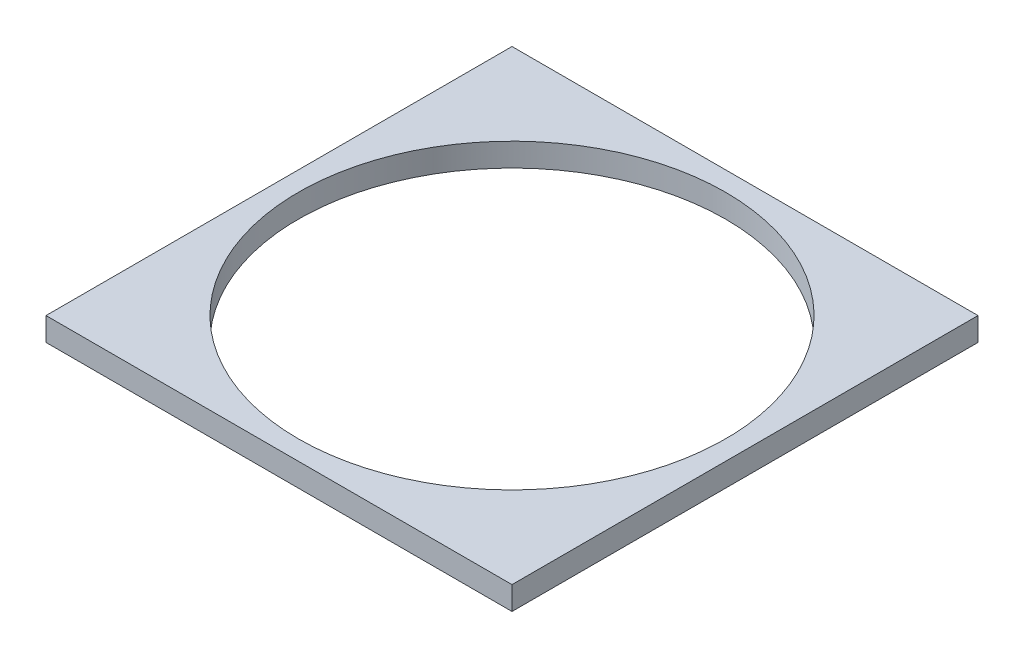
ISO-10303-21;
HEADER;
FILE_DESCRIPTION(('STEP AP214'),'2;1');
FILE_NAME('part.step','',(''),(''),'','','');
FILE_SCHEMA(('AUTOMOTIVE_DESIGN { 1 0 10303 214 1 1 1 1 }'));
ENDSEC;
DATA;
#1=APPLICATION_CONTEXT('core data for automotive mechanical design processes');
#2=APPLICATION_PROTOCOL_DEFINITION('international standard','automotive_design',2000,#1);
#3=PRODUCT_CONTEXT('',#1,'mechanical');
#4=PRODUCT('Part','Part','',(#3));
#5=PRODUCT_RELATED_PRODUCT_CATEGORY('part','',(#4));
#6=PRODUCT_DEFINITION_FORMATION('','',#4);
#7=PRODUCT_DEFINITION_CONTEXT('part definition',#1,'design');
#8=PRODUCT_DEFINITION('design','',#6,#7);
#9=PRODUCT_DEFINITION_SHAPE('','',#8);
#10=(LENGTH_UNIT() NAMED_UNIT(*) SI_UNIT(.MILLI.,.METRE.));
#11=(NAMED_UNIT(*) PLANE_ANGLE_UNIT() SI_UNIT($,.RADIAN.));
#12=(NAMED_UNIT(*) SI_UNIT($,.STERADIAN.) SOLID_ANGLE_UNIT());
#13=UNCERTAINTY_MEASURE_WITH_UNIT(LENGTH_MEASURE(1.E-05),#10,'distance_accuracy_value','');
#14=(GEOMETRIC_REPRESENTATION_CONTEXT(3) GLOBAL_UNCERTAINTY_ASSIGNED_CONTEXT((#13)) GLOBAL_UNIT_ASSIGNED_CONTEXT((#10,
#11,#12)) REPRESENTATION_CONTEXT('',''));
#15=CARTESIAN_POINT('',(0.,0.,0.));
#16=DIRECTION('',(0.,0.,1.));
#17=DIRECTION('',(1.,0.,0.));
#18=AXIS2_PLACEMENT_3D('',#15,#16,#17);
#19=CARTESIAN_POINT('',(0.,7.62,0.));
#20=DIRECTION('',(0.,1.,0.));
#21=DIRECTION('',(0.,0.,1.));
#22=AXIS2_PLACEMENT_3D('',#19,#20,#21);
#23=PLANE('',#22);
#24=DIRECTION('',(0.,0.,-1.));
#25=VECTOR('',#24,1.);
#26=CARTESIAN_POINT('',(76.2,7.62,-76.2));
#27=LINE('',#26,#25);
#28=CARTESIAN_POINT('',(76.2,7.62,76.2));
#29=VERTEX_POINT('',#28);
#30=CARTESIAN_POINT('',(76.2,7.62,-76.2));
#31=VERTEX_POINT('',#30);
#32=EDGE_CURVE('E90',#29,#31,#27,.T.);
#33=ORIENTED_EDGE('',*,*,#32,.T.);
#34=DIRECTION('',(-1.,0.,0.));
#35=VECTOR('',#34,1.);
#36=CARTESIAN_POINT('',(-76.2,7.62,-76.2));
#37=LINE('',#36,#35);
#38=CARTESIAN_POINT('',(-76.2,7.62,-76.2));
#39=VERTEX_POINT('',#38);
#40=EDGE_CURVE('E85',#31,#39,#37,.T.);
#41=ORIENTED_EDGE('',*,*,#40,.T.);
#42=DIRECTION('',(0.,0.,1.));
#43=VECTOR('',#42,1.);
#44=CARTESIAN_POINT('',(-76.2,7.62,-76.2));
#45=LINE('',#44,#43);
#46=CARTESIAN_POINT('',(-76.2,7.62,76.2));
#47=VERTEX_POINT('',#46);
#48=EDGE_CURVE('E88',#39,#47,#45,.T.);
#49=ORIENTED_EDGE('',*,*,#48,.T.);
#50=DIRECTION('',(1.,0.,0.));
#51=VECTOR('',#50,1.);
#52=CARTESIAN_POINT('',(-76.2,7.62,76.2));
#53=LINE('',#52,#51);
#54=EDGE_CURVE('E55',#47,#29,#53,.T.);
#55=ORIENTED_EDGE('',*,*,#54,.T.);
#56=EDGE_LOOP('',(#33,#41,#49,#55));
#57=FACE_BOUND('',#56,.T.);
#58=CARTESIAN_POINT('',(0.,7.62,0.));
#59=DIRECTION('',(0.,1.,0.));
#60=DIRECTION('',(0.,0.,1.));
#61=AXIS2_PLACEMENT_3D('',#58,#59,#60);
#62=CIRCLE('',#61,69.85);
#63=CARTESIAN_POINT('',(0.,7.62,69.85));
#64=VERTEX_POINT('',#63);
#65=EDGE_CURVE('E105',#64,#64,#62,.T.);
#66=ORIENTED_EDGE('',*,*,#65,.F.);
#67=EDGE_LOOP('',(#66));
#68=FACE_BOUND('',#67,.T.);
#69=ADVANCED_FACE('F38',(#57,#68),#23,.T.);
#70=CARTESIAN_POINT('',(0.,0.,0.));
#71=DIRECTION('',(0.,1.,0.));
#72=DIRECTION('',(0.,0.,1.));
#73=AXIS2_PLACEMENT_3D('',#70,#71,#72);
#74=PLANE('',#73);
#75=DIRECTION('',(0.,0.,-1.));
#76=VECTOR('',#75,1.);
#77=CARTESIAN_POINT('',(76.2,0.,-76.2));
#78=LINE('',#77,#76);
#79=CARTESIAN_POINT('',(76.2,0.,76.2));
#80=VERTEX_POINT('',#79);
#81=CARTESIAN_POINT('',(76.2,0.,-76.2));
#82=VERTEX_POINT('',#81);
#83=EDGE_CURVE('E102',#80,#82,#78,.T.);
#84=ORIENTED_EDGE('',*,*,#83,.F.);
#85=DIRECTION('',(1.,0.,0.));
#86=VECTOR('',#85,1.);
#87=CARTESIAN_POINT('',(-76.2,0.,76.2));
#88=LINE('',#87,#86);
#89=CARTESIAN_POINT('',(-76.2,0.,76.2));
#90=VERTEX_POINT('',#89);
#91=EDGE_CURVE('E78',#90,#80,#88,.T.);
#92=ORIENTED_EDGE('',*,*,#91,.F.);
#93=DIRECTION('',(0.,0.,1.));
#94=VECTOR('',#93,1.);
#95=CARTESIAN_POINT('',(-76.2,0.,-76.2));
#96=LINE('',#95,#94);
#97=CARTESIAN_POINT('',(-76.2,0.,-76.2));
#98=VERTEX_POINT('',#97);
#99=EDGE_CURVE('E72',#98,#90,#96,.T.);
#100=ORIENTED_EDGE('',*,*,#99,.F.);
#101=DIRECTION('',(-1.,0.,0.));
#102=VECTOR('',#101,1.);
#103=CARTESIAN_POINT('',(-76.2,0.,-76.2));
#104=LINE('',#103,#102);
#105=EDGE_CURVE('E94',#82,#98,#104,.T.);
#106=ORIENTED_EDGE('',*,*,#105,.F.);
#107=EDGE_LOOP('',(#84,#92,#100,#106));
#108=FACE_BOUND('',#107,.T.);
#109=CARTESIAN_POINT('',(0.,0.,0.));
#110=DIRECTION('',(0.,1.,0.));
#111=DIRECTION('',(0.,0.,1.));
#112=AXIS2_PLACEMENT_3D('',#109,#110,#111);
#113=CIRCLE('',#112,69.85);
#114=CARTESIAN_POINT('',(0.,0.,69.85));
#115=VERTEX_POINT('',#114);
#116=EDGE_CURVE('E117',#115,#115,#113,.T.);
#117=ORIENTED_EDGE('',*,*,#116,.T.);
#118=EDGE_LOOP('',(#117));
#119=FACE_BOUND('',#118,.T.);
#120=ADVANCED_FACE('F113',(#108,#119),#74,.F.);
#121=CARTESIAN_POINT('',(76.2,7.62,-76.2));
#122=DIRECTION('',(-1.,0.,0.));
#123=DIRECTION('',(0.,0.,1.));
#124=AXIS2_PLACEMENT_3D('',#121,#122,#123);
#125=PLANE('',#124);
#126=ORIENTED_EDGE('',*,*,#83,.T.);
#127=DIRECTION('',(0.,-1.,0.));
#128=VECTOR('',#127,1.);
#129=CARTESIAN_POINT('',(76.2,7.62,-76.2));
#130=LINE('',#129,#128);
#131=EDGE_CURVE('E11',#31,#82,#130,.T.);
#132=ORIENTED_EDGE('',*,*,#131,.F.);
#133=ORIENTED_EDGE('',*,*,#32,.F.);
#134=DIRECTION('',(0.,-1.,0.));
#135=VECTOR('',#134,1.);
#136=CARTESIAN_POINT('',(76.2,7.62,76.2));
#137=LINE('',#136,#135);
#138=EDGE_CURVE('E98',#29,#80,#137,.T.);
#139=ORIENTED_EDGE('',*,*,#138,.T.);
#140=EDGE_LOOP('',(#126,#132,#133,#139));
#141=FACE_BOUND('',#140,.T.);
#142=ADVANCED_FACE('F40',(#141),#125,.F.);
#143=CARTESIAN_POINT('',(-76.2,7.62,-76.2));
#144=DIRECTION('',(0.,0.,1.));
#145=DIRECTION('',(1.,0.,0.));
#146=AXIS2_PLACEMENT_3D('',#143,#144,#145);
#147=PLANE('',#146);
#148=ORIENTED_EDGE('',*,*,#105,.T.);
#149=DIRECTION('',(0.,-1.,0.));
#150=VECTOR('',#149,1.);
#151=CARTESIAN_POINT('',(-76.2,7.62,-76.2));
#152=LINE('',#151,#150);
#153=EDGE_CURVE('E47',#39,#98,#152,.T.);
#154=ORIENTED_EDGE('',*,*,#153,.F.);
#155=ORIENTED_EDGE('',*,*,#40,.F.);
#156=ORIENTED_EDGE('',*,*,#131,.T.);
#157=EDGE_LOOP('',(#148,#154,#155,#156));
#158=FACE_BOUND('',#157,.T.);
#159=ADVANCED_FACE('F93',(#158),#147,.F.);
#160=CARTESIAN_POINT('',(-76.2,7.62,-76.2));
#161=DIRECTION('',(1.,0.,0.));
#162=DIRECTION('',(0.,0.,-1.));
#163=AXIS2_PLACEMENT_3D('',#160,#161,#162);
#164=PLANE('',#163);
#165=ORIENTED_EDGE('',*,*,#99,.T.);
#166=DIRECTION('',(0.,-1.,0.));
#167=VECTOR('',#166,1.);
#168=CARTESIAN_POINT('',(-76.2,7.62,76.2));
#169=LINE('',#168,#167);
#170=EDGE_CURVE('E95',#47,#90,#169,.T.);
#171=ORIENTED_EDGE('',*,*,#170,.F.);
#172=ORIENTED_EDGE('',*,*,#48,.F.);
#173=ORIENTED_EDGE('',*,*,#153,.T.);
#174=EDGE_LOOP('',(#165,#171,#172,#173));
#175=FACE_BOUND('',#174,.T.);
#176=ADVANCED_FACE('F96',(#175),#164,.F.);
#177=CARTESIAN_POINT('',(-76.2,7.62,76.2));
#178=DIRECTION('',(0.,0.,-1.));
#179=DIRECTION('',(-1.,0.,0.));
#180=AXIS2_PLACEMENT_3D('',#177,#178,#179);
#181=PLANE('',#180);
#182=ORIENTED_EDGE('',*,*,#91,.T.);
#183=ORIENTED_EDGE('',*,*,#138,.F.);
#184=ORIENTED_EDGE('',*,*,#54,.F.);
#185=ORIENTED_EDGE('',*,*,#170,.T.);
#186=EDGE_LOOP('',(#182,#183,#184,#185));
#187=FACE_BOUND('',#186,.T.);
#188=ADVANCED_FACE('F110',(#187),#181,.F.);
#189=CARTESIAN_POINT('',(0.,7.62,0.));
#190=DIRECTION('',(0.,-1.,0.));
#191=DIRECTION('',(0.,0.,-1.));
#192=AXIS2_PLACEMENT_3D('',#189,#190,#191);
#193=CYLINDRICAL_SURFACE('',#192,69.85);
#194=ORIENTED_EDGE('',*,*,#65,.T.);
#195=EDGE_LOOP('',(#194));
#196=FACE_BOUND('',#195,.T.);
#197=ORIENTED_EDGE('',*,*,#116,.F.);
#198=EDGE_LOOP('',(#197));
#199=FACE_BOUND('',#198,.T.);
#200=ADVANCED_FACE('F123',(#196,#199),#193,.F.);
#201=CLOSED_SHELL('',(#69,#120,#142,#159,#176,#188,#200));
#202=MANIFOLD_SOLID_BREP('B2',#201);
#203=ADVANCED_BREP_SHAPE_REPRESENTATION('',(#18,#202),#14);
#204=SHAPE_DEFINITION_REPRESENTATION(#9,#203);
ENDSEC;
END-ISO-10303-21;
